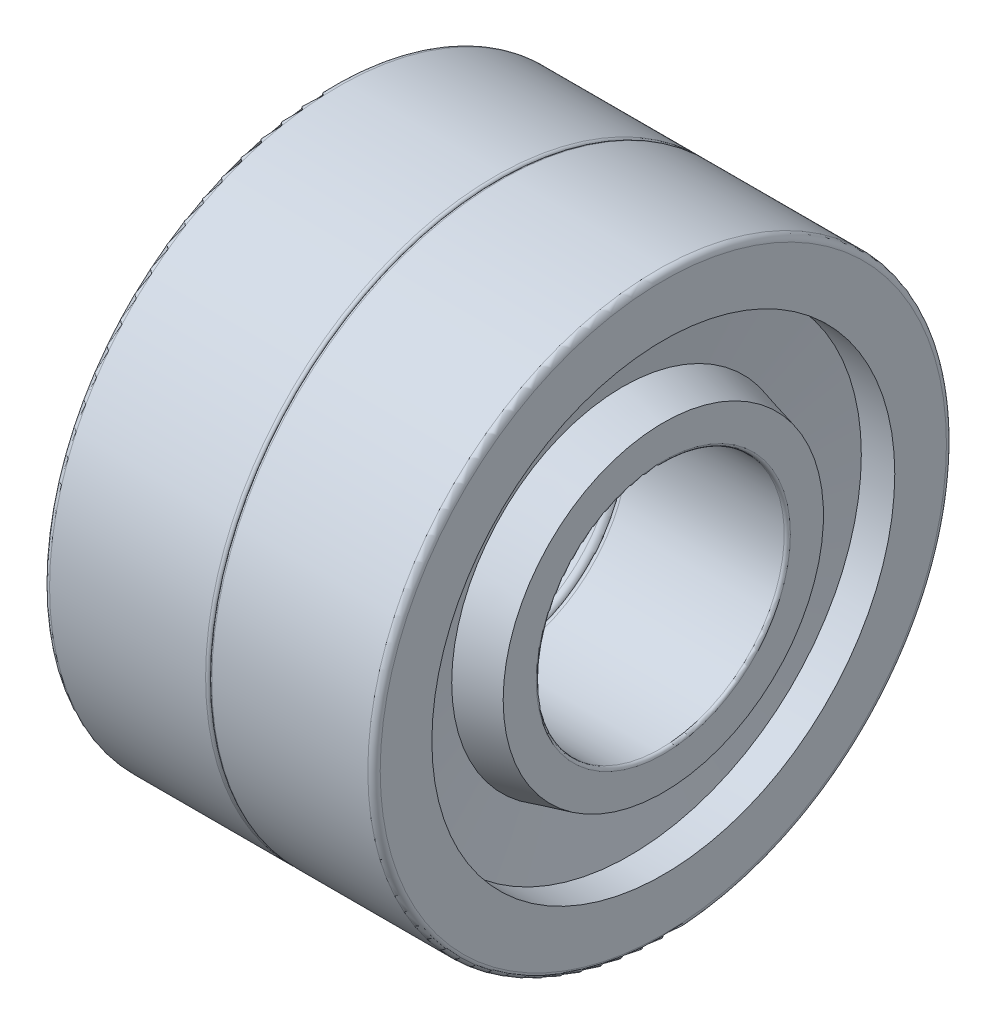
ISO-10303-21;
HEADER;
FILE_DESCRIPTION(('STEP AP214'),'2;1');
FILE_NAME('part.step','',(''),(''),'','','');
FILE_SCHEMA(('AUTOMOTIVE_DESIGN { 1 0 10303 214 1 1 1 1 }'));
ENDSEC;
DATA;
#1=APPLICATION_CONTEXT('core data for automotive mechanical design processes');
#2=APPLICATION_PROTOCOL_DEFINITION('international standard','automotive_design',2000,#1);
#3=PRODUCT_CONTEXT('',#1,'mechanical');
#4=PRODUCT('Part','Part','',(#3));
#5=PRODUCT_RELATED_PRODUCT_CATEGORY('part','',(#4));
#6=PRODUCT_DEFINITION_FORMATION('','',#4);
#7=PRODUCT_DEFINITION_CONTEXT('part definition',#1,'design');
#8=PRODUCT_DEFINITION('design','',#6,#7);
#9=PRODUCT_DEFINITION_SHAPE('','',#8);
#10=(LENGTH_UNIT() NAMED_UNIT(*) SI_UNIT(.MILLI.,.METRE.));
#11=(NAMED_UNIT(*) PLANE_ANGLE_UNIT() SI_UNIT($,.RADIAN.));
#12=(NAMED_UNIT(*) SI_UNIT($,.STERADIAN.) SOLID_ANGLE_UNIT());
#13=UNCERTAINTY_MEASURE_WITH_UNIT(LENGTH_MEASURE(1.E-05),#10,'distance_accuracy_value','');
#14=(GEOMETRIC_REPRESENTATION_CONTEXT(3) GLOBAL_UNCERTAINTY_ASSIGNED_CONTEXT((#13)) GLOBAL_UNIT_ASSIGNED_CONTEXT((#10,
#11,#12)) REPRESENTATION_CONTEXT('',''));
#15=CARTESIAN_POINT('',(0.,0.,0.));
#16=DIRECTION('',(0.,0.,1.));
#17=DIRECTION('',(1.,0.,0.));
#18=AXIS2_PLACEMENT_3D('',#15,#16,#17);
#19=CARTESIAN_POINT('',(9.925,0.,0.));
#20=DIRECTION('',(-1.,0.,0.));
#21=DIRECTION('',(0.,0.,1.));
#22=AXIS2_PLACEMENT_3D('',#19,#20,#21);
#23=CYLINDRICAL_SURFACE('',#22,6.);
#24=CARTESIAN_POINT('',(13.7,0.,0.));
#25=DIRECTION('',(1.,0.,0.));
#26=DIRECTION('',(0.,0.,1.));
#27=AXIS2_PLACEMENT_3D('',#24,#25,#26);
#28=CIRCLE('',#27,6.);
#29=CARTESIAN_POINT('',(13.7,0.,6.));
#30=VERTEX_POINT('',#29);
#31=EDGE_CURVE('E148',#30,#30,#28,.F.);
#32=ORIENTED_EDGE('',*,*,#31,.F.);
#33=EDGE_LOOP('',(#32));
#34=FACE_BOUND('',#33,.T.);
#35=CARTESIAN_POINT('',(6.15,0.,0.));
#36=DIRECTION('',(1.,0.,0.));
#37=DIRECTION('',(0.,0.,1.));
#38=AXIS2_PLACEMENT_3D('',#35,#36,#37);
#39=CIRCLE('',#38,6.00000000000001);
#40=CARTESIAN_POINT('',(6.15,0.,6.00000000000001));
#41=VERTEX_POINT('',#40);
#42=EDGE_CURVE('E143',#41,#41,#39,.T.);
#43=ORIENTED_EDGE('',*,*,#42,.F.);
#44=EDGE_LOOP('',(#43));
#45=FACE_BOUND('',#44,.T.);
#46=ADVANCED_FACE('F18',(#34,#45),#23,.F.);
#47=CARTESIAN_POINT('',(13.7,0.,0.));
#48=DIRECTION('',(1.,0.,0.));
#49=DIRECTION('',(0.,0.,1.));
#50=AXIS2_PLACEMENT_3D('',#47,#48,#49);
#51=TOROIDAL_SURFACE('',#50,6.3,0.300000000000002);
#52=ORIENTED_EDGE('',*,*,#31,.T.);
#53=EDGE_LOOP('',(#52));
#54=FACE_BOUND('',#53,.T.);
#55=CARTESIAN_POINT('',(14.,0.,0.));
#56=DIRECTION('',(1.,0.,0.));
#57=DIRECTION('',(0.,0.,1.));
#58=AXIS2_PLACEMENT_3D('',#55,#56,#57);
#59=CIRCLE('',#58,6.3);
#60=CARTESIAN_POINT('',(14.,0.,6.3));
#61=VERTEX_POINT('',#60);
#62=EDGE_CURVE('E136',#61,#61,#59,.F.);
#63=ORIENTED_EDGE('',*,*,#62,.F.);
#64=EDGE_LOOP('',(#63));
#65=FACE_BOUND('',#64,.T.);
#66=ADVANCED_FACE('F125',(#54,#65),#51,.T.);
#67=CARTESIAN_POINT('',(6.15000000000001,0.,0.));
#68=DIRECTION('',(1.,0.,0.));
#69=DIRECTION('',(0.,0.,1.));
#70=AXIS2_PLACEMENT_3D('',#67,#68,#69);
#71=TOROIDAL_SURFACE('',#70,6.15000000000001,0.150000000000005);
#72=ORIENTED_EDGE('',*,*,#42,.T.);
#73=EDGE_LOOP('',(#72));
#74=FACE_BOUND('',#73,.T.);
#75=CARTESIAN_POINT('',(6.00000000000001,0.,0.));
#76=DIRECTION('',(-1.,0.,0.));
#77=DIRECTION('',(0.,0.,-1.));
#78=AXIS2_PLACEMENT_3D('',#75,#76,#77);
#79=CIRCLE('',#78,6.15);
#80=CARTESIAN_POINT('',(6.,-6.15,0.));
#81=VERTEX_POINT('',#80);
#82=CARTESIAN_POINT('',(6.,0.,-6.15));
#83=VERTEX_POINT('',#82);
#84=EDGE_CURVE('E77',#81,#83,#79,.F.);
#85=ORIENTED_EDGE('',*,*,#84,.F.);
#86=CARTESIAN_POINT('',(6.00000000000001,0.,0.));
#87=DIRECTION('',(-1.,0.,0.));
#88=DIRECTION('',(0.,-1.,0.));
#89=AXIS2_PLACEMENT_3D('',#86,#87,#88);
#90=CIRCLE('',#89,6.15);
#91=CARTESIAN_POINT('',(6.,0.,6.15));
#92=VERTEX_POINT('',#91);
#93=EDGE_CURVE('E74',#92,#81,#90,.F.);
#94=ORIENTED_EDGE('',*,*,#93,.F.);
#95=CARTESIAN_POINT('',(6.00000000000001,0.,0.));
#96=DIRECTION('',(-1.,0.,0.));
#97=DIRECTION('',(0.,0.,1.));
#98=AXIS2_PLACEMENT_3D('',#95,#96,#97);
#99=CIRCLE('',#98,6.15000000000001);
#100=EDGE_CURVE('E71',#83,#92,#99,.F.);
#101=ORIENTED_EDGE('',*,*,#100,.F.);
#102=EDGE_LOOP('',(#85,#94,#101));
#103=FACE_BOUND('',#102,.T.);
#104=ADVANCED_FACE('F76',(#74,#103),#71,.T.);
#105=CARTESIAN_POINT('',(14.3,0.,0.));
#106=DIRECTION('',(1.,0.,0.));
#107=DIRECTION('',(0.,0.,1.));
#108=AXIS2_PLACEMENT_3D('',#105,#106,#107);
#109=TOROIDAL_SURFACE('',#108,6.3,0.299999999999999);
#110=ORIENTED_EDGE('',*,*,#62,.T.);
#111=EDGE_LOOP('',(#110));
#112=FACE_BOUND('',#111,.T.);
#113=CARTESIAN_POINT('',(14.3,0.,0.));
#114=DIRECTION('',(-1.,0.,0.));
#115=DIRECTION('',(0.,0.,1.));
#116=AXIS2_PLACEMENT_3D('',#113,#114,#115);
#117=CIRCLE('',#116,6.);
#118=CARTESIAN_POINT('',(14.3,0.,6.));
#119=VERTEX_POINT('',#118);
#120=EDGE_CURVE('E81',#119,#119,#117,.F.);
#121=ORIENTED_EDGE('',*,*,#120,.T.);
#122=EDGE_LOOP('',(#121));
#123=FACE_BOUND('',#122,.T.);
#124=ADVANCED_FACE('F106',(#112,#123),#109,.T.);
#125=CARTESIAN_POINT('',(6.,-6.95,0.));
#126=DIRECTION('',(-1.,0.,0.));
#127=DIRECTION('',(0.,0.,1.));
#128=AXIS2_PLACEMENT_3D('',#125,#126,#127);
#129=PLANE('',#128);
#130=ORIENTED_EDGE('',*,*,#100,.T.);
#131=ORIENTED_EDGE('',*,*,#93,.T.);
#132=ORIENTED_EDGE('',*,*,#84,.T.);
#133=EDGE_LOOP('',(#130,#131,#132));
#134=FACE_BOUND('',#133,.T.);
#135=CARTESIAN_POINT('',(6.,0.,0.));
#136=DIRECTION('',(1.,0.,0.));
#137=DIRECTION('',(0.,0.,-1.));
#138=AXIS2_PLACEMENT_3D('',#135,#136,#137);
#139=CIRCLE('',#138,7.75000000000001);
#140=CARTESIAN_POINT('',(6.,0.,-7.75000000000001));
#141=VERTEX_POINT('',#140);
#142=EDGE_CURVE('E120',#141,#141,#139,.T.);
#143=ORIENTED_EDGE('',*,*,#142,.F.);
#144=EDGE_LOOP('',(#143));
#145=FACE_BOUND('',#144,.T.);
#146=ADVANCED_FACE('F85',(#134,#145),#129,.T.);
#147=CARTESIAN_POINT('',(18.075,0.,0.));
#148=DIRECTION('',(-1.,0.,0.));
#149=DIRECTION('',(0.,0.,1.));
#150=AXIS2_PLACEMENT_3D('',#147,#148,#149);
#151=CYLINDRICAL_SURFACE('',#150,6.);
#152=CARTESIAN_POINT('',(21.85,0.,0.));
#153=DIRECTION('',(1.,0.,0.));
#154=DIRECTION('',(0.,0.,1.));
#155=AXIS2_PLACEMENT_3D('',#152,#153,#154);
#156=CIRCLE('',#155,6.);
#157=CARTESIAN_POINT('',(21.85,0.,6.));
#158=VERTEX_POINT('',#157);
#159=EDGE_CURVE('E167',#158,#158,#156,.F.);
#160=ORIENTED_EDGE('',*,*,#159,.F.);
#161=EDGE_LOOP('',(#160));
#162=FACE_BOUND('',#161,.T.);
#163=ORIENTED_EDGE('',*,*,#120,.F.);
#164=EDGE_LOOP('',(#163));
#165=FACE_BOUND('',#164,.T.);
#166=ADVANCED_FACE('F105',(#162,#165),#151,.F.);
#167=CARTESIAN_POINT('',(7.97254571313665,0.,0.));
#168=DIRECTION('',(1.,0.,0.));
#169=DIRECTION('',(0.,0.,-1.));
#170=AXIS2_PLACEMENT_3D('',#167,#168,#169);
#171=CONICAL_SURFACE('',#170,8.26779324969838,0.256708330433386);
#172=CARTESIAN_POINT('',(7.97254571313666,0.,0.));
#173=DIRECTION('',(-1.,0.,0.));
#174=DIRECTION('',(0.,-1.,0.));
#175=AXIS2_PLACEMENT_3D('',#172,#173,#174);
#176=CIRCLE('',#175,8.26779324969837);
#177=CARTESIAN_POINT('',(7.97254571313666,-8.26779324969837,0.));
#178=VERTEX_POINT('',#177);
#179=EDGE_CURVE('E326',#178,#178,#176,.T.);
#180=ORIENTED_EDGE('',*,*,#179,.T.);
#181=EDGE_LOOP('',(#180));
#182=FACE_BOUND('',#181,.T.);
#183=ORIENTED_EDGE('',*,*,#142,.T.);
#184=EDGE_LOOP('',(#183));
#185=FACE_BOUND('',#184,.T.);
#186=ADVANCED_FACE('F311',(#182,#185),#171,.T.);
#187=CARTESIAN_POINT('',(21.85,0.,0.));
#188=DIRECTION('',(1.,0.,0.));
#189=DIRECTION('',(0.,0.,1.));
#190=AXIS2_PLACEMENT_3D('',#187,#188,#189);
#191=TOROIDAL_SURFACE('',#190,6.15,0.150000000000001);
#192=ORIENTED_EDGE('',*,*,#159,.T.);
#193=EDGE_LOOP('',(#192));
#194=FACE_BOUND('',#193,.T.);
#195=CARTESIAN_POINT('',(22.,0.,0.));
#196=DIRECTION('',(1.,0.,0.));
#197=DIRECTION('',(0.,0.,-1.));
#198=AXIS2_PLACEMENT_3D('',#195,#196,#197);
#199=CIRCLE('',#198,6.15);
#200=CARTESIAN_POINT('',(22.,0.,6.15));
#201=VERTEX_POINT('',#200);
#202=CARTESIAN_POINT('',(22.,0.,-6.15));
#203=VERTEX_POINT('',#202);
#204=EDGE_CURVE('E322',#201,#203,#199,.F.);
#205=ORIENTED_EDGE('',*,*,#204,.F.);
#206=CARTESIAN_POINT('',(22.,0.,0.));
#207=DIRECTION('',(1.,0.,0.));
#208=DIRECTION('',(0.,0.,1.));
#209=AXIS2_PLACEMENT_3D('',#206,#207,#208);
#210=CIRCLE('',#209,6.15);
#211=CARTESIAN_POINT('',(22.,-6.15,0.));
#212=VERTEX_POINT('',#211);
#213=EDGE_CURVE('E293',#212,#201,#210,.F.);
#214=ORIENTED_EDGE('',*,*,#213,.F.);
#215=CARTESIAN_POINT('',(22.,0.,0.));
#216=DIRECTION('',(1.,0.,0.));
#217=DIRECTION('',(0.,-1.,0.));
#218=AXIS2_PLACEMENT_3D('',#215,#216,#217);
#219=CIRCLE('',#218,6.15);
#220=EDGE_CURVE('E334',#203,#212,#219,.F.);
#221=ORIENTED_EDGE('',*,*,#220,.F.);
#222=EDGE_LOOP('',(#205,#214,#221));
#223=FACE_BOUND('',#222,.T.);
#224=ADVANCED_FACE('F300',(#194,#223),#191,.T.);
#225=CARTESIAN_POINT('',(7.61859052006776,0.,0.));
#226=DIRECTION('',(-1.,0.,0.));
#227=DIRECTION('',(0.,0.,1.));
#228=AXIS2_PLACEMENT_3D('',#225,#226,#227);
#229=CONICAL_SURFACE('',#228,11.2,1.45066467587054);
#230=CARTESIAN_POINT('',(7.61859052006777,0.,0.));
#231=DIRECTION('',(-1.,0.,0.));
#232=DIRECTION('',(0.,0.,1.));
#233=AXIS2_PLACEMENT_3D('',#230,#231,#232);
#234=CIRCLE('',#233,11.2);
#235=CARTESIAN_POINT('',(7.61859052006777,0.,11.2));
#236=VERTEX_POINT('',#235);
#237=EDGE_CURVE('E164',#236,#236,#234,.T.);
#238=ORIENTED_EDGE('',*,*,#237,.T.);
#239=EDGE_LOOP('',(#238));
#240=FACE_BOUND('',#239,.T.);
#241=ORIENTED_EDGE('',*,*,#179,.F.);
#242=EDGE_LOOP('',(#241));
#243=FACE_BOUND('',#242,.T.);
#244=ADVANCED_FACE('F310',(#240,#243),#229,.F.);
#245=CARTESIAN_POINT('',(22.,-6.95,0.));
#246=DIRECTION('',(1.,0.,0.));
#247=DIRECTION('',(0.,0.,-1.));
#248=AXIS2_PLACEMENT_3D('',#245,#246,#247);
#249=PLANE('',#248);
#250=CARTESIAN_POINT('',(22.,0.,0.));
#251=DIRECTION('',(-1.,0.,0.));
#252=DIRECTION('',(0.,0.,1.));
#253=AXIS2_PLACEMENT_3D('',#250,#251,#252);
#254=CIRCLE('',#253,7.75000000000001);
#255=CARTESIAN_POINT('',(22.,0.,7.75000000000001));
#256=VERTEX_POINT('',#255);
#257=EDGE_CURVE('E161',#256,#256,#254,.T.);
#258=ORIENTED_EDGE('',*,*,#257,.F.);
#259=EDGE_LOOP('',(#258));
#260=FACE_BOUND('',#259,.T.);
#261=ORIENTED_EDGE('',*,*,#213,.T.);
#262=ORIENTED_EDGE('',*,*,#204,.T.);
#263=ORIENTED_EDGE('',*,*,#220,.T.);
#264=EDGE_LOOP('',(#261,#262,#263));
#265=FACE_BOUND('',#264,.T.);
#266=ADVANCED_FACE('F512',(#260,#265),#249,.T.);
#267=CARTESIAN_POINT('',(6.80929526003388,0.,0.));
#268=DIRECTION('',(-1.,0.,0.));
#269=DIRECTION('',(0.,0.,1.));
#270=AXIS2_PLACEMENT_3D('',#267,#268,#269);
#271=CYLINDRICAL_SURFACE('',#270,11.2);
#272=CARTESIAN_POINT('',(6.,0.,0.));
#273=DIRECTION('',(-1.,0.,0.));
#274=DIRECTION('',(0.,0.,1.));
#275=AXIS2_PLACEMENT_3D('',#272,#273,#274);
#276=CIRCLE('',#275,11.2);
#277=CARTESIAN_POINT('',(6.,0.,11.2));
#278=VERTEX_POINT('',#277);
#279=EDGE_CURVE('E157',#278,#278,#276,.F.);
#280=ORIENTED_EDGE('',*,*,#279,.F.);
#281=EDGE_LOOP('',(#280));
#282=FACE_BOUND('',#281,.T.);
#283=ORIENTED_EDGE('',*,*,#237,.F.);
#284=EDGE_LOOP('',(#283));
#285=FACE_BOUND('',#284,.T.);
#286=ADVANCED_FACE('F502',(#282,#285),#271,.F.);
#287=CARTESIAN_POINT('',(20.0274542868634,0.,0.));
#288=DIRECTION('',(-1.,0.,0.));
#289=DIRECTION('',(0.,0.,1.));
#290=AXIS2_PLACEMENT_3D('',#287,#288,#289);
#291=CONICAL_SURFACE('',#290,8.26779324969837,0.256708330433386);
#292=ORIENTED_EDGE('',*,*,#257,.T.);
#293=EDGE_LOOP('',(#292));
#294=FACE_BOUND('',#293,.T.);
#295=CARTESIAN_POINT('',(20.0274542868634,0.,0.));
#296=DIRECTION('',(1.,0.,0.));
#297=DIRECTION('',(0.,-1.,0.));
#298=AXIS2_PLACEMENT_3D('',#295,#296,#297);
#299=CIRCLE('',#298,8.26779324969838);
#300=CARTESIAN_POINT('',(20.0274542868634,-8.26779324969838,0.));
#301=VERTEX_POINT('',#300);
#302=EDGE_CURVE('E160',#301,#301,#299,.T.);
#303=ORIENTED_EDGE('',*,*,#302,.T.);
#304=EDGE_LOOP('',(#303));
#305=FACE_BOUND('',#304,.T.);
#306=ADVANCED_FACE('F493',(#294,#305),#291,.T.);
#307=CARTESIAN_POINT('',(6.,-12.45,0.));
#308=DIRECTION('',(-1.,0.,0.));
#309=DIRECTION('',(0.,0.,1.));
#310=AXIS2_PLACEMENT_3D('',#307,#308,#309);
#311=PLANE('',#310);
#312=ORIENTED_EDGE('',*,*,#279,.T.);
#313=EDGE_LOOP('',(#312));
#314=FACE_BOUND('',#313,.T.);
#315=CARTESIAN_POINT('',(6.,0.,0.));
#316=DIRECTION('',(1.,0.,0.));
#317=DIRECTION('',(0.,0.,1.));
#318=AXIS2_PLACEMENT_3D('',#315,#316,#317);
#319=CIRCLE('',#318,13.7);
#320=CARTESIAN_POINT('',(6.,0.,13.7));
#321=VERTEX_POINT('',#320);
#322=CARTESIAN_POINT('',(6.,-13.7,0.));
#323=VERTEX_POINT('',#322);
#324=EDGE_CURVE('E745',#321,#323,#319,.T.);
#325=ORIENTED_EDGE('',*,*,#324,.F.);
#326=CARTESIAN_POINT('',(6.,0.,0.));
#327=DIRECTION('',(1.,0.,0.));
#328=DIRECTION('',(0.,0.,-1.));
#329=AXIS2_PLACEMENT_3D('',#326,#327,#328);
#330=CIRCLE('',#329,13.7);
#331=CARTESIAN_POINT('',(6.,0.,-13.7));
#332=VERTEX_POINT('',#331);
#333=EDGE_CURVE('E737',#332,#321,#330,.T.);
#334=ORIENTED_EDGE('',*,*,#333,.F.);
#335=CARTESIAN_POINT('',(6.,0.,0.));
#336=DIRECTION('',(1.,0.,0.));
#337=DIRECTION('',(0.,-1.,0.));
#338=AXIS2_PLACEMENT_3D('',#335,#336,#337);
#339=CIRCLE('',#338,13.7);
#340=EDGE_CURVE('E280',#323,#332,#339,.T.);
#341=ORIENTED_EDGE('',*,*,#340,.F.);
#342=EDGE_LOOP('',(#325,#334,#341));
#343=FACE_BOUND('',#342,.T.);
#344=ADVANCED_FACE('F484',(#314,#343),#311,.T.);
#345=CARTESIAN_POINT('',(20.3814094799322,0.,0.));
#346=DIRECTION('',(1.,0.,0.));
#347=DIRECTION('',(0.,0.,-1.));
#348=AXIS2_PLACEMENT_3D('',#345,#346,#347);
#349=CONICAL_SURFACE('',#348,11.2,1.45066467587054);
#350=ORIENTED_EDGE('',*,*,#302,.F.);
#351=EDGE_LOOP('',(#350));
#352=FACE_BOUND('',#351,.T.);
#353=CARTESIAN_POINT('',(20.3814094799322,0.,0.));
#354=DIRECTION('',(-1.,0.,0.));
#355=DIRECTION('',(0.,0.,1.));
#356=AXIS2_PLACEMENT_3D('',#353,#354,#355);
#357=CIRCLE('',#356,11.2);
#358=CARTESIAN_POINT('',(20.3814094799322,0.,11.2));
#359=VERTEX_POINT('',#358);
#360=EDGE_CURVE('E248',#359,#359,#357,.F.);
#361=ORIENTED_EDGE('',*,*,#360,.T.);
#362=EDGE_LOOP('',(#361));
#363=FACE_BOUND('',#362,.T.);
#364=ADVANCED_FACE('F256',(#352,#363),#349,.F.);
#365=CARTESIAN_POINT('',(6.3,0.,0.));
#366=DIRECTION('',(1.,0.,0.));
#367=DIRECTION('',(0.,0.,1.));
#368=AXIS2_PLACEMENT_3D('',#365,#366,#367);
#369=TOROIDAL_SURFACE('',#368,13.7,0.300000000000004);
#370=CARTESIAN_POINT('',(6.3,0.,0.));
#371=DIRECTION('',(-1.,0.,0.));
#372=DIRECTION('',(0.,0.,1.));
#373=AXIS2_PLACEMENT_3D('',#370,#371,#372);
#374=CIRCLE('',#373,14.);
#375=CARTESIAN_POINT('',(6.3,0.,14.));
#376=VERTEX_POINT('',#375);
#377=EDGE_CURVE('E156',#376,#376,#374,.F.);
#378=ORIENTED_EDGE('',*,*,#377,.F.);
#379=EDGE_LOOP('',(#378));
#380=FACE_BOUND('',#379,.T.);
#381=ORIENTED_EDGE('',*,*,#333,.T.);
#382=ORIENTED_EDGE('',*,*,#324,.T.);
#383=ORIENTED_EDGE('',*,*,#340,.T.);
#384=EDGE_LOOP('',(#381,#382,#383));
#385=FACE_BOUND('',#384,.T.);
#386=ADVANCED_FACE('F251',(#380,#385),#369,.T.);
#387=CARTESIAN_POINT('',(21.1907047399661,0.,0.));
#388=DIRECTION('',(-1.,0.,0.));
#389=DIRECTION('',(0.,0.,1.));
#390=AXIS2_PLACEMENT_3D('',#387,#388,#389);
#391=CYLINDRICAL_SURFACE('',#390,11.2);
#392=ORIENTED_EDGE('',*,*,#360,.F.);
#393=EDGE_LOOP('',(#392));
#394=FACE_BOUND('',#393,.T.);
#395=CARTESIAN_POINT('',(22.,0.,0.));
#396=DIRECTION('',(-1.,0.,0.));
#397=DIRECTION('',(0.,0.,1.));
#398=AXIS2_PLACEMENT_3D('',#395,#396,#397);
#399=CIRCLE('',#398,11.2);
#400=CARTESIAN_POINT('',(22.,0.,11.2));
#401=VERTEX_POINT('',#400);
#402=EDGE_CURVE('E152',#401,#401,#399,.T.);
#403=ORIENTED_EDGE('',*,*,#402,.F.);
#404=EDGE_LOOP('',(#403));
#405=FACE_BOUND('',#404,.T.);
#406=ADVANCED_FACE('F255',(#394,#405),#391,.F.);
#407=CARTESIAN_POINT('',(10.075,0.,0.));
#408=DIRECTION('',(-1.,0.,0.));
#409=DIRECTION('',(0.,0.,1.));
#410=AXIS2_PLACEMENT_3D('',#407,#408,#409);
#411=CYLINDRICAL_SURFACE('',#410,14.);
#412=ORIENTED_EDGE('',*,*,#377,.T.);
#413=EDGE_LOOP('',(#412));
#414=FACE_BOUND('',#413,.T.);
#415=CARTESIAN_POINT('',(13.85,0.,0.));
#416=DIRECTION('',(1.,0.,0.));
#417=DIRECTION('',(0.,0.,1.));
#418=AXIS2_PLACEMENT_3D('',#415,#416,#417);
#419=CIRCLE('',#418,14.);
#420=CARTESIAN_POINT('',(13.85,0.,14.));
#421=VERTEX_POINT('',#420);
#422=EDGE_CURVE('E155',#421,#421,#419,.T.);
#423=ORIENTED_EDGE('',*,*,#422,.F.);
#424=EDGE_LOOP('',(#423));
#425=FACE_BOUND('',#424,.T.);
#426=ADVANCED_FACE('F215',(#414,#425),#411,.T.);
#427=CARTESIAN_POINT('',(22.,-12.45,0.));
#428=DIRECTION('',(1.,0.,0.));
#429=DIRECTION('',(0.,0.,-1.));
#430=AXIS2_PLACEMENT_3D('',#427,#428,#429);
#431=PLANE('',#430);
#432=CARTESIAN_POINT('',(22.,0.,0.));
#433=DIRECTION('',(-1.,0.,0.));
#434=DIRECTION('',(0.,0.,1.));
#435=AXIS2_PLACEMENT_3D('',#432,#433,#434);
#436=CIRCLE('',#435,13.7);
#437=CARTESIAN_POINT('',(22.,0.,13.7));
#438=VERTEX_POINT('',#437);
#439=CARTESIAN_POINT('',(22.,0.,-13.7));
#440=VERTEX_POINT('',#439);
#441=EDGE_CURVE('E233',#438,#440,#436,.T.);
#442=ORIENTED_EDGE('',*,*,#441,.F.);
#443=CARTESIAN_POINT('',(22.,0.,0.));
#444=DIRECTION('',(-1.,0.,0.));
#445=DIRECTION('',(0.,-1.,0.));
#446=AXIS2_PLACEMENT_3D('',#443,#444,#445);
#447=CIRCLE('',#446,13.7);
#448=CARTESIAN_POINT('',(22.,-13.7,0.));
#449=VERTEX_POINT('',#448);
#450=EDGE_CURVE('E231',#449,#438,#447,.T.);
#451=ORIENTED_EDGE('',*,*,#450,.F.);
#452=CARTESIAN_POINT('',(22.,0.,0.));
#453=DIRECTION('',(-1.,0.,0.));
#454=DIRECTION('',(0.,0.,-1.));
#455=AXIS2_PLACEMENT_3D('',#452,#453,#454);
#456=CIRCLE('',#455,13.7);
#457=EDGE_CURVE('E38',#440,#449,#456,.T.);
#458=ORIENTED_EDGE('',*,*,#457,.F.);
#459=EDGE_LOOP('',(#442,#451,#458));
#460=FACE_BOUND('',#459,.T.);
#461=ORIENTED_EDGE('',*,*,#402,.T.);
#462=EDGE_LOOP('',(#461));
#463=FACE_BOUND('',#462,.T.);
#464=ADVANCED_FACE('F206',(#460,#463),#431,.T.);
#465=CARTESIAN_POINT('',(13.85,0.,0.));
#466=DIRECTION('',(1.,0.,0.));
#467=DIRECTION('',(0.,0.,1.));
#468=AXIS2_PLACEMENT_3D('',#465,#466,#467);
#469=TOROIDAL_SURFACE('',#468,13.85,0.150000000000006);
#470=ORIENTED_EDGE('',*,*,#422,.T.);
#471=EDGE_LOOP('',(#470));
#472=FACE_BOUND('',#471,.T.);
#473=CARTESIAN_POINT('',(14.,0.,0.));
#474=DIRECTION('',(1.,0.,0.));
#475=DIRECTION('',(0.,0.,1.));
#476=AXIS2_PLACEMENT_3D('',#473,#474,#475);
#477=CIRCLE('',#476,13.85);
#478=CARTESIAN_POINT('',(14.,0.,13.85));
#479=VERTEX_POINT('',#478);
#480=EDGE_CURVE('E197',#479,#479,#477,.T.);
#481=ORIENTED_EDGE('',*,*,#480,.F.);
#482=EDGE_LOOP('',(#481));
#483=FACE_BOUND('',#482,.T.);
#484=ADVANCED_FACE('F187',(#472,#483),#469,.T.);
#485=CARTESIAN_POINT('',(21.7,0.,0.));
#486=DIRECTION('',(1.,0.,0.));
#487=DIRECTION('',(0.,0.,1.));
#488=AXIS2_PLACEMENT_3D('',#485,#486,#487);
#489=TOROIDAL_SURFACE('',#488,13.7,0.300000000000001);
#490=ORIENTED_EDGE('',*,*,#450,.T.);
#491=ORIENTED_EDGE('',*,*,#441,.T.);
#492=ORIENTED_EDGE('',*,*,#457,.T.);
#493=EDGE_LOOP('',(#490,#491,#492));
#494=FACE_BOUND('',#493,.T.);
#495=CARTESIAN_POINT('',(21.7,0.,0.));
#496=DIRECTION('',(-1.,0.,0.));
#497=DIRECTION('',(0.,0.,1.));
#498=AXIS2_PLACEMENT_3D('',#495,#496,#497);
#499=CIRCLE('',#498,14.);
#500=CARTESIAN_POINT('',(21.7,0.,14.));
#501=VERTEX_POINT('',#500);
#502=EDGE_CURVE('E29',#501,#501,#499,.T.);
#503=ORIENTED_EDGE('',*,*,#502,.F.);
#504=EDGE_LOOP('',(#503));
#505=FACE_BOUND('',#504,.T.);
#506=ADVANCED_FACE('F175',(#494,#505),#489,.T.);
#507=CARTESIAN_POINT('',(14.15,0.,0.));
#508=DIRECTION('',(1.,0.,0.));
#509=DIRECTION('',(0.,0.,1.));
#510=AXIS2_PLACEMENT_3D('',#507,#508,#509);
#511=TOROIDAL_SURFACE('',#510,13.85,0.150000000000005);
#512=ORIENTED_EDGE('',*,*,#480,.T.);
#513=EDGE_LOOP('',(#512));
#514=FACE_BOUND('',#513,.T.);
#515=CARTESIAN_POINT('',(14.15,0.,0.));
#516=DIRECTION('',(-1.,0.,0.));
#517=DIRECTION('',(0.,0.,1.));
#518=AXIS2_PLACEMENT_3D('',#515,#516,#517);
#519=CIRCLE('',#518,14.);
#520=CARTESIAN_POINT('',(14.15,0.,14.));
#521=VERTEX_POINT('',#520);
#522=EDGE_CURVE('E11',#521,#521,#519,.F.);
#523=ORIENTED_EDGE('',*,*,#522,.F.);
#524=EDGE_LOOP('',(#523));
#525=FACE_BOUND('',#524,.T.);
#526=ADVANCED_FACE('F186',(#514,#525),#511,.T.);
#527=CARTESIAN_POINT('',(17.925,0.,0.));
#528=DIRECTION('',(-1.,0.,0.));
#529=DIRECTION('',(0.,0.,1.));
#530=AXIS2_PLACEMENT_3D('',#527,#528,#529);
#531=CYLINDRICAL_SURFACE('',#530,14.);
#532=ORIENTED_EDGE('',*,*,#502,.T.);
#533=EDGE_LOOP('',(#532));
#534=FACE_BOUND('',#533,.T.);
#535=ORIENTED_EDGE('',*,*,#522,.T.);
#536=EDGE_LOOP('',(#535));
#537=FACE_BOUND('',#536,.T.);
#538=ADVANCED_FACE('F347',(#534,#537),#531,.T.);
#539=CLOSED_SHELL('',(#46,#66,#104,#124,#146,#166,#186,#224,#244,#266,#286,#306,#344,#364,#386,
#406,#426,#464,#484,#506,#526,#538));
#540=CARTESIAN_POINT('',(12.0274542868634,0.,0.));
#541=DIRECTION('',(-1.,0.,0.));
#542=DIRECTION('',(0.,0.,1.));
#543=AXIS2_PLACEMENT_3D('',#540,#541,#542);
#544=CONICAL_SURFACE('',#543,11.7322067503016,1.45066467587054);
#545=CARTESIAN_POINT('',(12.0274542868634,0.,0.));
#546=DIRECTION('',(1.,0.,0.));
#547=DIRECTION('',(0.,-1.,0.));
#548=AXIS2_PLACEMENT_3D('',#545,#546,#547);
#549=CIRCLE('',#548,11.7322067503016);
#550=CARTESIAN_POINT('',(12.0274542868634,-11.7322067503016,0.));
#551=VERTEX_POINT('',#550);
#552=EDGE_CURVE('E392',#551,#551,#549,.T.);
#553=ORIENTED_EDGE('',*,*,#552,.T.);
#554=EDGE_LOOP('',(#553));
#555=FACE_BOUND('',#554,.T.);
#556=CARTESIAN_POINT('',(12.3814094799322,0.,0.));
#557=DIRECTION('',(-1.,0.,0.));
#558=DIRECTION('',(0.,0.,1.));
#559=AXIS2_PLACEMENT_3D('',#556,#557,#558);
#560=CIRCLE('',#559,8.8);
#561=CARTESIAN_POINT('',(12.3814094799322,0.,8.8));
#562=VERTEX_POINT('',#561);
#563=EDGE_CURVE('E387',#562,#562,#560,.F.);
#564=ORIENTED_EDGE('',*,*,#563,.F.);
#565=EDGE_LOOP('',(#564));
#566=FACE_BOUND('',#565,.T.);
#567=ADVANCED_FACE('F355',(#555,#566),#544,.T.);
#568=CARTESIAN_POINT('',(14.,0.,0.));
#569=DIRECTION('',(1.,0.,0.));
#570=DIRECTION('',(0.,0.,-1.));
#571=AXIS2_PLACEMENT_3D('',#568,#569,#570);
#572=CONICAL_SURFACE('',#571,12.25,0.256708330433386);
#573=CARTESIAN_POINT('',(14.,0.,0.));
#574=DIRECTION('',(-1.,0.,0.));
#575=DIRECTION('',(0.,-1.,0.));
#576=AXIS2_PLACEMENT_3D('',#573,#574,#575);
#577=CIRCLE('',#576,12.25);
#578=CARTESIAN_POINT('',(14.,-12.25,0.));
#579=VERTEX_POINT('',#578);
#580=EDGE_CURVE('E383',#579,#579,#577,.F.);
#581=ORIENTED_EDGE('',*,*,#580,.T.);
#582=EDGE_LOOP('',(#581));
#583=FACE_BOUND('',#582,.T.);
#584=ORIENTED_EDGE('',*,*,#552,.F.);
#585=EDGE_LOOP('',(#584));
#586=FACE_BOUND('',#585,.T.);
#587=ADVANCED_FACE('F357',(#583,#586),#572,.F.);
#588=CARTESIAN_POINT('',(14.,0.,0.));
#589=DIRECTION('',(-1.,0.,0.));
#590=DIRECTION('',(0.,0.,1.));
#591=AXIS2_PLACEMENT_3D('',#588,#589,#590);
#592=CYLINDRICAL_SURFACE('',#591,8.8);
#593=ORIENTED_EDGE('',*,*,#563,.T.);
#594=EDGE_LOOP('',(#593));
#595=FACE_BOUND('',#594,.T.);
#596=CARTESIAN_POINT('',(15.6185905200678,0.,0.));
#597=DIRECTION('',(1.,0.,0.));
#598=DIRECTION('',(0.,-1.,0.));
#599=AXIS2_PLACEMENT_3D('',#596,#597,#598);
#600=CIRCLE('',#599,8.80000000000001);
#601=CARTESIAN_POINT('',(15.6185905200678,-8.80000000000001,0.));
#602=VERTEX_POINT('',#601);
#603=EDGE_CURVE('E151',#602,#602,#600,.T.);
#604=ORIENTED_EDGE('',*,*,#603,.F.);
#605=EDGE_LOOP('',(#604));
#606=FACE_BOUND('',#605,.T.);
#607=ADVANCED_FACE('F362',(#595,#606),#592,.T.);
#608=CARTESIAN_POINT('',(14.,0.,0.));
#609=DIRECTION('',(-1.,0.,0.));
#610=DIRECTION('',(0.,0.,1.));
#611=AXIS2_PLACEMENT_3D('',#608,#609,#610);
#612=CONICAL_SURFACE('',#611,12.25,0.256708330433386);
#613=CARTESIAN_POINT('',(15.9725457131366,0.,0.));
#614=DIRECTION('',(1.,0.,0.));
#615=DIRECTION('',(0.,-1.,0.));
#616=AXIS2_PLACEMENT_3D('',#613,#614,#615);
#617=CIRCLE('',#616,11.7322067503016);
#618=CARTESIAN_POINT('',(15.9725457131366,-11.7322067503016,0.));
#619=VERTEX_POINT('',#618);
#620=EDGE_CURVE('E382',#619,#619,#617,.F.);
#621=ORIENTED_EDGE('',*,*,#620,.F.);
#622=EDGE_LOOP('',(#621));
#623=FACE_BOUND('',#622,.T.);
#624=ORIENTED_EDGE('',*,*,#580,.F.);
#625=EDGE_LOOP('',(#624));
#626=FACE_BOUND('',#625,.T.);
#627=ADVANCED_FACE('F366',(#623,#626),#612,.F.);
#628=CARTESIAN_POINT('',(15.9725457131366,0.,0.));
#629=DIRECTION('',(1.,0.,0.));
#630=DIRECTION('',(0.,0.,-1.));
#631=AXIS2_PLACEMENT_3D('',#628,#629,#630);
#632=CONICAL_SURFACE('',#631,11.7322067503016,1.45066467587054);
#633=ORIENTED_EDGE('',*,*,#603,.T.);
#634=EDGE_LOOP('',(#633));
#635=FACE_BOUND('',#634,.T.);
#636=ORIENTED_EDGE('',*,*,#620,.T.);
#637=EDGE_LOOP('',(#636));
#638=FACE_BOUND('',#637,.T.);
#639=ADVANCED_FACE('F370',(#635,#638),#632,.T.);
#640=CLOSED_SHELL('',(#567,#587,#607,#627,#639));
#641=ORIENTED_CLOSED_SHELL('',*,#640,.T.);
#642=BREP_WITH_VOIDS('B1',#539,(#641));
#643=ADVANCED_BREP_SHAPE_REPRESENTATION('',(#18,#642),#14);
#644=SHAPE_DEFINITION_REPRESENTATION(#9,#643);
ENDSEC;
END-ISO-10303-21;
